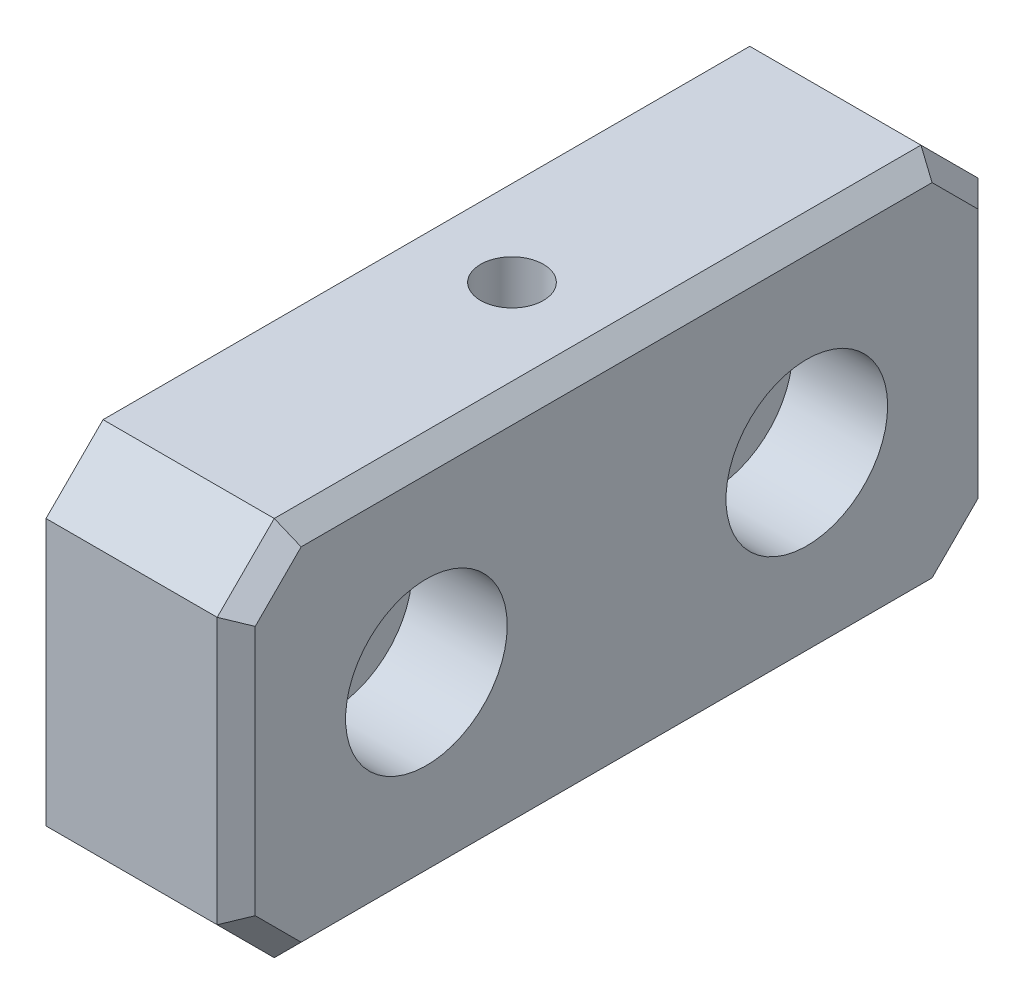
ISO-10303-21;
HEADER;
FILE_DESCRIPTION(('STEP AP214'),'2;1');
FILE_NAME('part.step','',(''),(''),'','','');
FILE_SCHEMA(('AUTOMOTIVE_DESIGN { 1 0 10303 214 1 1 1 1 }'));
ENDSEC;
DATA;
#1=APPLICATION_CONTEXT('core data for automotive mechanical design processes');
#2=APPLICATION_PROTOCOL_DEFINITION('international standard','automotive_design',2000,#1);
#3=PRODUCT_CONTEXT('',#1,'mechanical');
#4=PRODUCT('Part','Part','',(#3));
#5=PRODUCT_RELATED_PRODUCT_CATEGORY('part','',(#4));
#6=PRODUCT_DEFINITION_FORMATION('','',#4);
#7=PRODUCT_DEFINITION_CONTEXT('part definition',#1,'design');
#8=PRODUCT_DEFINITION('design','',#6,#7);
#9=PRODUCT_DEFINITION_SHAPE('','',#8);
#10=(LENGTH_UNIT() NAMED_UNIT(*) SI_UNIT(.MILLI.,.METRE.));
#11=(NAMED_UNIT(*) PLANE_ANGLE_UNIT() SI_UNIT($,.RADIAN.));
#12=(NAMED_UNIT(*) SI_UNIT($,.STERADIAN.) SOLID_ANGLE_UNIT());
#13=UNCERTAINTY_MEASURE_WITH_UNIT(LENGTH_MEASURE(1.E-05),#10,'distance_accuracy_value','');
#14=(GEOMETRIC_REPRESENTATION_CONTEXT(3) GLOBAL_UNCERTAINTY_ASSIGNED_CONTEXT((#13)) GLOBAL_UNIT_ASSIGNED_CONTEXT((#10,
#11,#12)) REPRESENTATION_CONTEXT('',''));
#15=CARTESIAN_POINT('',(0.,0.,0.));
#16=DIRECTION('',(0.,0.,1.));
#17=DIRECTION('',(1.,0.,0.));
#18=AXIS2_PLACEMENT_3D('',#15,#16,#17);
#19=CARTESIAN_POINT('',(10.,0.,0.));
#20=DIRECTION('',(1.,0.,0.));
#21=DIRECTION('',(0.,0.,-1.));
#22=AXIS2_PLACEMENT_3D('',#19,#20,#21);
#23=PLANE('',#22);
#24=DIRECTION('',(0.,0.,-1.));
#25=VECTOR('',#24,1.);
#26=CARTESIAN_POINT('',(10.,-9.,-17.));
#27=LINE('',#26,#25);
#28=CARTESIAN_POINT('',(10.,-9.,16.5857864376269));
#29=VERTEX_POINT('',#28);
#30=CARTESIAN_POINT('',(10.,-9.,-16.5857864376269));
#31=VERTEX_POINT('',#30);
#32=EDGE_CURVE('E188',#29,#31,#27,.T.);
#33=ORIENTED_EDGE('',*,*,#32,.T.);
#34=DIRECTION('',(0.,0.707106781186547,-0.707106781186548));
#35=VECTOR('',#34,1.);
#36=CARTESIAN_POINT('',(10.,-12.7928932188135,-12.7928932188134));
#37=LINE('',#36,#35);
#38=CARTESIAN_POINT('',(10.,-6.58578643762691,-19.));
#39=VERTEX_POINT('',#38);
#40=EDGE_CURVE('E190',#31,#39,#37,.T.);
#41=ORIENTED_EDGE('',*,*,#40,.T.);
#42=DIRECTION('',(0.,1.,0.));
#43=VECTOR('',#42,1.);
#44=CARTESIAN_POINT('',(10.,6.99999999999997,-19.));
#45=LINE('',#44,#43);
#46=CARTESIAN_POINT('',(10.,6.58578643762688,-19.));
#47=VERTEX_POINT('',#46);
#48=EDGE_CURVE('E176',#39,#47,#45,.T.);
#49=ORIENTED_EDGE('',*,*,#48,.T.);
#50=DIRECTION('',(0.,0.707106781186549,0.707106781186546));
#51=VECTOR('',#50,1.);
#52=CARTESIAN_POINT('',(10.,12.7928932188134,-12.7928932188135));
#53=LINE('',#52,#51);
#54=CARTESIAN_POINT('',(10.,9.,-16.5857864376269));
#55=VERTEX_POINT('',#54);
#56=EDGE_CURVE('E178',#47,#55,#53,.T.);
#57=ORIENTED_EDGE('',*,*,#56,.T.);
#58=DIRECTION('',(0.,0.,1.));
#59=VECTOR('',#58,1.);
#60=CARTESIAN_POINT('',(10.,9.,17.));
#61=LINE('',#60,#59);
#62=CARTESIAN_POINT('',(10.,9.,16.5857864376269));
#63=VERTEX_POINT('',#62);
#64=EDGE_CURVE('E180',#55,#63,#61,.T.);
#65=ORIENTED_EDGE('',*,*,#64,.T.);
#66=DIRECTION('',(0.,-0.707106781186547,0.707106781186548));
#67=VECTOR('',#66,1.);
#68=CARTESIAN_POINT('',(10.,12.7928932188135,12.7928932188134));
#69=LINE('',#68,#67);
#70=CARTESIAN_POINT('',(10.,6.58578643762689,19.));
#71=VERTEX_POINT('',#70);
#72=EDGE_CURVE('E182',#63,#71,#69,.T.);
#73=ORIENTED_EDGE('',*,*,#72,.T.);
#74=DIRECTION('',(0.,-1.,0.));
#75=VECTOR('',#74,1.);
#76=CARTESIAN_POINT('',(10.,-6.99999999999999,19.));
#77=LINE('',#76,#75);
#78=CARTESIAN_POINT('',(10.,-6.58578643762689,19.));
#79=VERTEX_POINT('',#78);
#80=EDGE_CURVE('E184',#71,#79,#77,.T.);
#81=ORIENTED_EDGE('',*,*,#80,.T.);
#82=DIRECTION('',(0.,-0.707106781186549,-0.707106781186546));
#83=VECTOR('',#82,1.);
#84=CARTESIAN_POINT('',(10.,-12.7928932188134,12.7928932188135));
#85=LINE('',#84,#83);
#86=EDGE_CURVE('E186',#79,#29,#85,.T.);
#87=ORIENTED_EDGE('',*,*,#86,.T.);
#88=EDGE_LOOP('',(#33,#41,#49,#57,#65,#73,#81,#87));
#89=FACE_BOUND('',#88,.T.);
#90=CARTESIAN_POINT('',(10.,0.,-10.));
#91=DIRECTION('',(1.,0.,0.));
#92=DIRECTION('',(0.,0.,-1.));
#93=AXIS2_PLACEMENT_3D('',#90,#91,#92);
#94=CIRCLE('',#93,4.25);
#95=CARTESIAN_POINT('',(10.,0.,-14.25));
#96=VERTEX_POINT('',#95);
#97=EDGE_CURVE('E480',#96,#96,#94,.F.);
#98=ORIENTED_EDGE('',*,*,#97,.T.);
#99=EDGE_LOOP('',(#98));
#100=FACE_BOUND('',#99,.T.);
#101=CARTESIAN_POINT('',(10.,0.,10.));
#102=DIRECTION('',(1.,0.,0.));
#103=DIRECTION('',(0.,0.,-1.));
#104=AXIS2_PLACEMENT_3D('',#101,#102,#103);
#105=CIRCLE('',#104,4.25);
#106=CARTESIAN_POINT('',(10.,0.,5.75));
#107=VERTEX_POINT('',#106);
#108=EDGE_CURVE('E493',#107,#107,#105,.T.);
#109=ORIENTED_EDGE('',*,*,#108,.F.);
#110=EDGE_LOOP('',(#109));
#111=FACE_BOUND('',#110,.T.);
#112=ADVANCED_FACE('F35',(#89,#100,#111),#23,.T.);
#113=CARTESIAN_POINT('',(0.,0.,-10.));
#114=DIRECTION('',(1.,0.,0.));
#115=DIRECTION('',(0.,0.,-1.));
#116=AXIS2_PLACEMENT_3D('',#113,#114,#115);
#117=CYLINDRICAL_SURFACE('',#116,2.25);
#118=CARTESIAN_POINT('',(0.,0.,-10.));
#119=DIRECTION('',(1.,0.,0.));
#120=DIRECTION('',(0.,0.,-1.));
#121=AXIS2_PLACEMENT_3D('',#118,#119,#120);
#122=CIRCLE('',#121,2.25);
#123=CARTESIAN_POINT('',(0.,0.,-12.25));
#124=VERTEX_POINT('',#123);
#125=EDGE_CURVE('E496',#124,#124,#122,.F.);
#126=ORIENTED_EDGE('',*,*,#125,.T.);
#127=EDGE_LOOP('',(#126));
#128=FACE_BOUND('',#127,.T.);
#129=CARTESIAN_POINT('',(5.,0.,-10.));
#130=DIRECTION('',(1.,0.,0.));
#131=DIRECTION('',(0.,0.,-1.));
#132=AXIS2_PLACEMENT_3D('',#129,#130,#131);
#133=CIRCLE('',#132,2.25);
#134=CARTESIAN_POINT('',(5.,0.,-12.25));
#135=VERTEX_POINT('',#134);
#136=EDGE_CURVE('E484',#135,#135,#133,.F.);
#137=ORIENTED_EDGE('',*,*,#136,.F.);
#138=EDGE_LOOP('',(#137));
#139=FACE_BOUND('',#138,.T.);
#140=ADVANCED_FACE('F295',(#128,#139),#117,.F.);
#141=CARTESIAN_POINT('',(0.,0.,10.));
#142=DIRECTION('',(1.,0.,0.));
#143=DIRECTION('',(0.,0.,-1.));
#144=AXIS2_PLACEMENT_3D('',#141,#142,#143);
#145=CYLINDRICAL_SURFACE('',#144,2.25);
#146=CARTESIAN_POINT('',(0.,0.,10.));
#147=DIRECTION('',(1.,0.,0.));
#148=DIRECTION('',(0.,0.,-1.));
#149=AXIS2_PLACEMENT_3D('',#146,#147,#148);
#150=CIRCLE('',#149,2.25);
#151=CARTESIAN_POINT('',(0.,0.,7.75));
#152=VERTEX_POINT('',#151);
#153=EDGE_CURVE('E209',#152,#152,#150,.T.);
#154=ORIENTED_EDGE('',*,*,#153,.F.);
#155=EDGE_LOOP('',(#154));
#156=FACE_BOUND('',#155,.T.);
#157=CARTESIAN_POINT('',(5.,0.,10.));
#158=DIRECTION('',(1.,0.,0.));
#159=DIRECTION('',(0.,0.,-1.));
#160=AXIS2_PLACEMENT_3D('',#157,#158,#159);
#161=CIRCLE('',#160,2.25);
#162=CARTESIAN_POINT('',(5.,0.,7.75));
#163=VERTEX_POINT('',#162);
#164=EDGE_CURVE('E492',#163,#163,#161,.T.);
#165=ORIENTED_EDGE('',*,*,#164,.T.);
#166=EDGE_LOOP('',(#165));
#167=FACE_BOUND('',#166,.T.);
#168=ADVANCED_FACE('F300',(#156,#167),#145,.F.);
#169=CARTESIAN_POINT('',(0.,0.,0.));
#170=DIRECTION('',(1.,0.,0.));
#171=DIRECTION('',(0.,0.,-1.));
#172=AXIS2_PLACEMENT_3D('',#169,#170,#171);
#173=PLANE('',#172);
#174=DIRECTION('',(0.,0.,1.));
#175=VECTOR('',#174,1.);
#176=CARTESIAN_POINT('',(0.,10.,20.));
#177=LINE('',#176,#175);
#178=CARTESIAN_POINT('',(0.,10.,-17.));
#179=VERTEX_POINT('',#178);
#180=CARTESIAN_POINT('',(0.,10.,17.));
#181=VERTEX_POINT('',#180);
#182=EDGE_CURVE('E129',#179,#181,#177,.T.);
#183=ORIENTED_EDGE('',*,*,#182,.F.);
#184=DIRECTION('',(0.,0.707106781186549,0.707106781186546));
#185=VECTOR('',#184,1.);
#186=CARTESIAN_POINT('',(0.,10.,-17.));
#187=LINE('',#186,#185);
#188=CARTESIAN_POINT('',(0.,6.99999999999997,-20.));
#189=VERTEX_POINT('',#188);
#190=EDGE_CURVE('E135',#179,#189,#187,.F.);
#191=ORIENTED_EDGE('',*,*,#190,.T.);
#192=DIRECTION('',(0.,1.,0.));
#193=VECTOR('',#192,1.);
#194=CARTESIAN_POINT('',(0.,10.,-20.));
#195=LINE('',#194,#193);
#196=CARTESIAN_POINT('',(0.,-7.,-20.));
#197=VERTEX_POINT('',#196);
#198=EDGE_CURVE('E149',#197,#189,#195,.T.);
#199=ORIENTED_EDGE('',*,*,#198,.F.);
#200=DIRECTION('',(0.,0.707106781186547,-0.707106781186548));
#201=VECTOR('',#200,1.);
#202=CARTESIAN_POINT('',(0.,-7.,-20.));
#203=LINE('',#202,#201);
#204=CARTESIAN_POINT('',(0.,-10.,-17.));
#205=VERTEX_POINT('',#204);
#206=EDGE_CURVE('E142',#197,#205,#203,.F.);
#207=ORIENTED_EDGE('',*,*,#206,.T.);
#208=DIRECTION('',(0.,0.,-1.));
#209=VECTOR('',#208,1.);
#210=CARTESIAN_POINT('',(0.,-10.,20.));
#211=LINE('',#210,#209);
#212=CARTESIAN_POINT('',(0.,-10.,17.));
#213=VERTEX_POINT('',#212);
#214=EDGE_CURVE('E152',#213,#205,#211,.T.);
#215=ORIENTED_EDGE('',*,*,#214,.F.);
#216=DIRECTION('',(0.,-0.707106781186549,-0.707106781186546));
#217=VECTOR('',#216,1.);
#218=CARTESIAN_POINT('',(0.,-10.,17.));
#219=LINE('',#218,#217);
#220=CARTESIAN_POINT('',(0.,-6.99999999999999,20.));
#221=VERTEX_POINT('',#220);
#222=EDGE_CURVE('E161',#213,#221,#219,.F.);
#223=ORIENTED_EDGE('',*,*,#222,.T.);
#224=DIRECTION('',(0.,-1.,0.));
#225=VECTOR('',#224,1.);
#226=CARTESIAN_POINT('',(0.,10.,20.));
#227=LINE('',#226,#225);
#228=CARTESIAN_POINT('',(0.,6.99999999999999,20.));
#229=VERTEX_POINT('',#228);
#230=EDGE_CURVE('E148',#229,#221,#227,.T.);
#231=ORIENTED_EDGE('',*,*,#230,.F.);
#232=DIRECTION('',(0.,-0.707106781186547,0.707106781186548));
#233=VECTOR('',#232,1.);
#234=CARTESIAN_POINT('',(0.,6.99999999999999,20.));
#235=LINE('',#234,#233);
#236=EDGE_CURVE('E132',#229,#181,#235,.F.);
#237=ORIENTED_EDGE('',*,*,#236,.T.);
#238=EDGE_LOOP('',(#183,#191,#199,#207,#215,#223,#231,#237));
#239=FACE_BOUND('',#238,.T.);
#240=ORIENTED_EDGE('',*,*,#125,.F.);
#241=EDGE_LOOP('',(#240));
#242=FACE_BOUND('',#241,.T.);
#243=ORIENTED_EDGE('',*,*,#153,.T.);
#244=EDGE_LOOP('',(#243));
#245=FACE_BOUND('',#244,.T.);
#246=ADVANCED_FACE('F144',(#239,#242,#245),#173,.F.);
#247=CARTESIAN_POINT('',(10.,10.,-20.));
#248=DIRECTION('',(0.,0.,1.));
#249=DIRECTION('',(1.,0.,0.));
#250=AXIS2_PLACEMENT_3D('',#247,#248,#249);
#251=PLANE('',#250);
#252=DIRECTION('',(1.,0.,0.));
#253=VECTOR('',#252,1.);
#254=CARTESIAN_POINT('',(10.,6.99999999999997,-20.));
#255=LINE('',#254,#253);
#256=CARTESIAN_POINT('',(8.99999999999999,6.99999999999997,-20.));
#257=VERTEX_POINT('',#256);
#258=EDGE_CURVE('E137',#189,#257,#255,.T.);
#259=ORIENTED_EDGE('',*,*,#258,.T.);
#260=DIRECTION('',(0.,-1.,0.));
#261=VECTOR('',#260,1.);
#262=CARTESIAN_POINT('',(8.99999999999999,-7.,-20.));
#263=LINE('',#262,#261);
#264=CARTESIAN_POINT('',(8.99999999999999,-7.,-20.));
#265=VERTEX_POINT('',#264);
#266=EDGE_CURVE('E11',#257,#265,#263,.T.);
#267=ORIENTED_EDGE('',*,*,#266,.T.);
#268=DIRECTION('',(-1.,0.,0.));
#269=VECTOR('',#268,1.);
#270=CARTESIAN_POINT('',(10.,-7.,-20.));
#271=LINE('',#270,#269);
#272=EDGE_CURVE('E141',#265,#197,#271,.T.);
#273=ORIENTED_EDGE('',*,*,#272,.T.);
#274=ORIENTED_EDGE('',*,*,#198,.T.);
#275=EDGE_LOOP('',(#259,#267,#273,#274));
#276=FACE_BOUND('',#275,.T.);
#277=ADVANCED_FACE('F273',(#276),#251,.F.);
#278=CARTESIAN_POINT('',(10.,10.,20.));
#279=DIRECTION('',(0.,-1.,0.));
#280=DIRECTION('',(0.,0.,-1.));
#281=AXIS2_PLACEMENT_3D('',#278,#279,#280);
#282=PLANE('',#281);
#283=CARTESIAN_POINT('',(4.5,10.,0.));
#284=DIRECTION('',(0.,1.,0.));
#285=DIRECTION('',(0.,0.,1.));
#286=AXIS2_PLACEMENT_3D('',#283,#284,#285);
#287=CIRCLE('',#286,1.65);
#288=CARTESIAN_POINT('',(4.5,10.,1.65));
#289=VERTEX_POINT('',#288);
#290=EDGE_CURVE('E481',#289,#289,#287,.T.);
#291=ORIENTED_EDGE('',*,*,#290,.F.);
#292=EDGE_LOOP('',(#291));
#293=FACE_BOUND('',#292,.T.);
#294=DIRECTION('',(1.,0.,0.));
#295=VECTOR('',#294,1.);
#296=CARTESIAN_POINT('',(10.,10.,17.));
#297=LINE('',#296,#295);
#298=CARTESIAN_POINT('',(8.99999999999999,10.,17.));
#299=VERTEX_POINT('',#298);
#300=EDGE_CURVE('E133',#181,#299,#297,.T.);
#301=ORIENTED_EDGE('',*,*,#300,.T.);
#302=DIRECTION('',(0.,0.,-1.));
#303=VECTOR('',#302,1.);
#304=CARTESIAN_POINT('',(8.99999999999999,10.,-17.));
#305=LINE('',#304,#303);
#306=CARTESIAN_POINT('',(8.99999999999999,10.,-17.));
#307=VERTEX_POINT('',#306);
#308=EDGE_CURVE('E60',#299,#307,#305,.T.);
#309=ORIENTED_EDGE('',*,*,#308,.T.);
#310=DIRECTION('',(-1.,0.,0.));
#311=VECTOR('',#310,1.);
#312=CARTESIAN_POINT('',(10.,10.,-17.));
#313=LINE('',#312,#311);
#314=EDGE_CURVE('E125',#307,#179,#313,.T.);
#315=ORIENTED_EDGE('',*,*,#314,.T.);
#316=ORIENTED_EDGE('',*,*,#182,.T.);
#317=EDGE_LOOP('',(#301,#309,#315,#316));
#318=FACE_BOUND('',#317,.T.);
#319=ADVANCED_FACE('F127',(#293,#318),#282,.F.);
#320=CARTESIAN_POINT('',(10.,10.,20.));
#321=DIRECTION('',(0.,0.,-1.));
#322=DIRECTION('',(0.,1.,0.));
#323=AXIS2_PLACEMENT_3D('',#320,#321,#322);
#324=PLANE('',#323);
#325=DIRECTION('',(1.,0.,0.));
#326=VECTOR('',#325,1.);
#327=CARTESIAN_POINT('',(10.,-6.99999999999999,20.));
#328=LINE('',#327,#326);
#329=CARTESIAN_POINT('',(8.99999999999999,-6.99999999999999,20.));
#330=VERTEX_POINT('',#329);
#331=EDGE_CURVE('E173',#221,#330,#328,.T.);
#332=ORIENTED_EDGE('',*,*,#331,.T.);
#333=DIRECTION('',(0.,1.,0.));
#334=VECTOR('',#333,1.);
#335=CARTESIAN_POINT('',(8.99999999999999,6.99999999999999,20.));
#336=LINE('',#335,#334);
#337=CARTESIAN_POINT('',(8.99999999999999,6.99999999999999,20.));
#338=VERTEX_POINT('',#337);
#339=EDGE_CURVE('E200',#330,#338,#336,.T.);
#340=ORIENTED_EDGE('',*,*,#339,.T.);
#341=DIRECTION('',(-1.,0.,0.));
#342=VECTOR('',#341,1.);
#343=CARTESIAN_POINT('',(10.,6.99999999999999,20.));
#344=LINE('',#343,#342);
#345=EDGE_CURVE('E171',#338,#229,#344,.T.);
#346=ORIENTED_EDGE('',*,*,#345,.T.);
#347=ORIENTED_EDGE('',*,*,#230,.T.);
#348=EDGE_LOOP('',(#332,#340,#346,#347));
#349=FACE_BOUND('',#348,.T.);
#350=ADVANCED_FACE('F241',(#349),#324,.F.);
#351=CARTESIAN_POINT('',(10.,-10.,20.));
#352=DIRECTION('',(0.,1.,0.));
#353=DIRECTION('',(0.,0.,1.));
#354=AXIS2_PLACEMENT_3D('',#351,#352,#353);
#355=PLANE('',#354);
#356=DIRECTION('',(1.,0.,0.));
#357=VECTOR('',#356,1.);
#358=CARTESIAN_POINT('',(10.,-10.,-17.));
#359=LINE('',#358,#357);
#360=CARTESIAN_POINT('',(8.99999999999999,-10.,-17.));
#361=VERTEX_POINT('',#360);
#362=EDGE_CURVE('E168',#205,#361,#359,.T.);
#363=ORIENTED_EDGE('',*,*,#362,.T.);
#364=DIRECTION('',(0.,0.,1.));
#365=VECTOR('',#364,1.);
#366=CARTESIAN_POINT('',(8.99999999999999,-10.,17.));
#367=LINE('',#366,#365);
#368=CARTESIAN_POINT('',(8.99999999999999,-10.,17.));
#369=VERTEX_POINT('',#368);
#370=EDGE_CURVE('E196',#361,#369,#367,.T.);
#371=ORIENTED_EDGE('',*,*,#370,.T.);
#372=DIRECTION('',(-1.,0.,0.));
#373=VECTOR('',#372,1.);
#374=CARTESIAN_POINT('',(10.,-10.,17.));
#375=LINE('',#374,#373);
#376=EDGE_CURVE('E166',#369,#213,#375,.T.);
#377=ORIENTED_EDGE('',*,*,#376,.T.);
#378=ORIENTED_EDGE('',*,*,#214,.T.);
#379=EDGE_LOOP('',(#363,#371,#377,#378));
#380=FACE_BOUND('',#379,.T.);
#381=ADVANCED_FACE('F307',(#380),#355,.F.);
#382=CARTESIAN_POINT('',(10.,10.,-17.));
#383=DIRECTION('',(0.,-0.707106781186546,0.707106781186549));
#384=DIRECTION('',(-1.,0.,0.));
#385=AXIS2_PLACEMENT_3D('',#382,#383,#384);
#386=PLANE('',#385);
#387=ORIENTED_EDGE('',*,*,#314,.F.);
#388=DIRECTION('',(0.,0.707106781186549,0.707106781186546));
#389=VECTOR('',#388,1.);
#390=CARTESIAN_POINT('',(8.99999999999999,10.,-17.));
#391=LINE('',#390,#389);
#392=EDGE_CURVE('E45',#307,#257,#391,.F.);
#393=ORIENTED_EDGE('',*,*,#392,.T.);
#394=ORIENTED_EDGE('',*,*,#258,.F.);
#395=ORIENTED_EDGE('',*,*,#190,.F.);
#396=EDGE_LOOP('',(#387,#393,#394,#395));
#397=FACE_BOUND('',#396,.T.);
#398=ADVANCED_FACE('F136',(#397),#386,.F.);
#399=CARTESIAN_POINT('',(10.,-7.,-20.));
#400=DIRECTION('',(0.,0.707106781186548,0.707106781186547));
#401=DIRECTION('',(-1.,0.,0.));
#402=AXIS2_PLACEMENT_3D('',#399,#400,#401);
#403=PLANE('',#402);
#404=ORIENTED_EDGE('',*,*,#272,.F.);
#405=DIRECTION('',(0.,0.707106781186547,-0.707106781186548));
#406=VECTOR('',#405,1.);
#407=CARTESIAN_POINT('',(8.99999999999999,-7.,-20.));
#408=LINE('',#407,#406);
#409=EDGE_CURVE('E193',#265,#361,#408,.F.);
#410=ORIENTED_EDGE('',*,*,#409,.T.);
#411=ORIENTED_EDGE('',*,*,#362,.F.);
#412=ORIENTED_EDGE('',*,*,#206,.F.);
#413=EDGE_LOOP('',(#404,#410,#411,#412));
#414=FACE_BOUND('',#413,.T.);
#415=ADVANCED_FACE('F277',(#414),#403,.F.);
#416=CARTESIAN_POINT('',(10.,-10.,17.));
#417=DIRECTION('',(0.,0.707106781186546,-0.707106781186549));
#418=DIRECTION('',(-1.,0.,0.));
#419=AXIS2_PLACEMENT_3D('',#416,#417,#418);
#420=PLANE('',#419);
#421=ORIENTED_EDGE('',*,*,#376,.F.);
#422=DIRECTION('',(0.,-0.707106781186549,-0.707106781186546));
#423=VECTOR('',#422,1.);
#424=CARTESIAN_POINT('',(8.99999999999999,-10.,17.));
#425=LINE('',#424,#423);
#426=EDGE_CURVE('E198',#369,#330,#425,.F.);
#427=ORIENTED_EDGE('',*,*,#426,.T.);
#428=ORIENTED_EDGE('',*,*,#331,.F.);
#429=ORIENTED_EDGE('',*,*,#222,.F.);
#430=EDGE_LOOP('',(#421,#427,#428,#429));
#431=FACE_BOUND('',#430,.T.);
#432=ADVANCED_FACE('F246',(#431),#420,.F.);
#433=CARTESIAN_POINT('',(10.,6.99999999999999,20.));
#434=DIRECTION('',(0.,-0.707106781186548,-0.707106781186547));
#435=DIRECTION('',(-1.,0.,0.));
#436=AXIS2_PLACEMENT_3D('',#433,#434,#435);
#437=PLANE('',#436);
#438=ORIENTED_EDGE('',*,*,#345,.F.);
#439=DIRECTION('',(0.,-0.707106781186547,0.707106781186548));
#440=VECTOR('',#439,1.);
#441=CARTESIAN_POINT('',(8.99999999999999,6.99999999999999,20.));
#442=LINE('',#441,#440);
#443=EDGE_CURVE('E202',#338,#299,#442,.F.);
#444=ORIENTED_EDGE('',*,*,#443,.T.);
#445=ORIENTED_EDGE('',*,*,#300,.F.);
#446=ORIENTED_EDGE('',*,*,#236,.F.);
#447=EDGE_LOOP('',(#438,#444,#445,#446));
#448=FACE_BOUND('',#447,.T.);
#449=ADVANCED_FACE('F239',(#448),#437,.F.);
#450=CARTESIAN_POINT('',(10.,12.7928932188135,12.7928932188134));
#451=DIRECTION('',(0.707106781186546,0.500000000000002,0.500000000000001));
#452=DIRECTION('',(0.,0.707106781186547,-0.707106781186548));
#453=AXIS2_PLACEMENT_3D('',#450,#451,#452);
#454=PLANE('',#453);
#455=DIRECTION('',(0.678598344545849,-0.678598344545845,-0.281084637714821));
#456=VECTOR('',#455,1.);
#457=CARTESIAN_POINT('',(13.16363211356,5.83636788643999,15.2753671098313));
#458=LINE('',#457,#456);
#459=EDGE_CURVE('E222',#299,#63,#458,.T.);
#460=ORIENTED_EDGE('',*,*,#459,.F.);
#461=ORIENTED_EDGE('',*,*,#443,.F.);
#462=DIRECTION('',(0.67859834454585,-0.281084637714826,-0.678598344545842));
#463=VECTOR('',#462,1.);
#464=CARTESIAN_POINT('',(11.6743803584745,5.89223538457561,17.3256196415255));
#465=LINE('',#464,#463);
#466=EDGE_CURVE('E40',#71,#338,#465,.F.);
#467=ORIENTED_EDGE('',*,*,#466,.F.);
#468=ORIENTED_EDGE('',*,*,#72,.F.);
#469=EDGE_LOOP('',(#460,#461,#467,#468));
#470=FACE_BOUND('',#469,.T.);
#471=ADVANCED_FACE('F38',(#470),#454,.T.);
#472=CARTESIAN_POINT('',(10.,0.,19.));
#473=DIRECTION('',(0.707106781186543,0.,0.707106781186552));
#474=DIRECTION('',(0.,1.,0.));
#475=AXIS2_PLACEMENT_3D('',#472,#473,#474);
#476=PLANE('',#475);
#477=ORIENTED_EDGE('',*,*,#466,.T.);
#478=ORIENTED_EDGE('',*,*,#339,.F.);
#479=DIRECTION('',(0.678598344545851,0.281084637714823,-0.678598344545842));
#480=VECTOR('',#479,1.);
#481=CARTESIAN_POINT('',(11.2561964152546,-6.06545284542398,17.7438035847455));
#482=LINE('',#481,#480);
#483=EDGE_CURVE('E220',#79,#330,#482,.F.);
#484=ORIENTED_EDGE('',*,*,#483,.F.);
#485=ORIENTED_EDGE('',*,*,#80,.F.);
#486=EDGE_LOOP('',(#477,#478,#484,#485));
#487=FACE_BOUND('',#486,.T.);
#488=ADVANCED_FACE('F232',(#487),#476,.T.);
#489=CARTESIAN_POINT('',(10.,9.,0.));
#490=DIRECTION('',(0.707106781186545,0.70710678118655,0.));
#491=DIRECTION('',(0.,0.,-1.));
#492=AXIS2_PLACEMENT_3D('',#489,#490,#491);
#493=PLANE('',#492);
#494=ORIENTED_EDGE('',*,*,#459,.T.);
#495=ORIENTED_EDGE('',*,*,#64,.F.);
#496=DIRECTION('',(0.678598344545849,-0.678598344545845,0.28108463771482));
#497=VECTOR('',#496,1.);
#498=CARTESIAN_POINT('',(8.97685892457637,10.0231410754236,-17.0095853472884));
#499=LINE('',#498,#497);
#500=EDGE_CURVE('E217',#307,#55,#499,.T.);
#501=ORIENTED_EDGE('',*,*,#500,.F.);
#502=ORIENTED_EDGE('',*,*,#308,.F.);
#503=EDGE_LOOP('',(#494,#495,#501,#502));
#504=FACE_BOUND('',#503,.T.);
#505=ADVANCED_FACE('F262',(#504),#493,.T.);
#506=CARTESIAN_POINT('',(10.,-12.7928932188134,12.7928932188135));
#507=DIRECTION('',(0.707106781186545,-0.5,0.500000000000003));
#508=DIRECTION('',(0.,0.707106781186549,0.707106781186546));
#509=AXIS2_PLACEMENT_3D('',#506,#507,#508);
#510=PLANE('',#509);
#511=ORIENTED_EDGE('',*,*,#483,.T.);
#512=ORIENTED_EDGE('',*,*,#426,.F.);
#513=DIRECTION('',(0.678598344545849,0.678598344545845,-0.281084637714821));
#514=VECTOR('',#513,1.);
#515=CARTESIAN_POINT('',(8.97685892457637,-10.0231410754236,17.0095853472884));
#516=LINE('',#515,#514);
#517=EDGE_CURVE('E214',#29,#369,#516,.F.);
#518=ORIENTED_EDGE('',*,*,#517,.F.);
#519=ORIENTED_EDGE('',*,*,#86,.F.);
#520=EDGE_LOOP('',(#511,#512,#518,#519));
#521=FACE_BOUND('',#520,.T.);
#522=ADVANCED_FACE('F251',(#521),#510,.T.);
#523=CARTESIAN_POINT('',(10.,12.7928932188134,-12.7928932188135));
#524=DIRECTION('',(0.707106781186545,0.500000000000001,-0.500000000000003));
#525=DIRECTION('',(0.,-0.707106781186549,-0.707106781186546));
#526=AXIS2_PLACEMENT_3D('',#523,#524,#525);
#527=PLANE('',#526);
#528=ORIENTED_EDGE('',*,*,#500,.T.);
#529=ORIENTED_EDGE('',*,*,#56,.F.);
#530=DIRECTION('',(0.67859834454585,-0.281084637714819,0.678598344545845));
#531=VECTOR('',#530,1.);
#532=CARTESIAN_POINT('',(11.2561964152545,6.06545284542399,-17.7438035847455));
#533=LINE('',#532,#531);
#534=EDGE_CURVE('E211',#257,#47,#533,.T.);
#535=ORIENTED_EDGE('',*,*,#534,.F.);
#536=ORIENTED_EDGE('',*,*,#392,.F.);
#537=EDGE_LOOP('',(#528,#529,#535,#536));
#538=FACE_BOUND('',#537,.T.);
#539=ADVANCED_FACE('F264',(#538),#527,.T.);
#540=CARTESIAN_POINT('',(10.,-9.,0.));
#541=DIRECTION('',(0.707106781186545,-0.70710678118655,0.));
#542=DIRECTION('',(0.,0.,1.));
#543=AXIS2_PLACEMENT_3D('',#540,#541,#542);
#544=PLANE('',#543);
#545=ORIENTED_EDGE('',*,*,#517,.T.);
#546=ORIENTED_EDGE('',*,*,#370,.F.);
#547=DIRECTION('',(0.67859834454585,0.678598344545845,0.281084637714819));
#548=VECTOR('',#547,1.);
#549=CARTESIAN_POINT('',(13.16363211356,-5.83636788644001,-15.2753671098313));
#550=LINE('',#549,#548);
#551=EDGE_CURVE('E208',#31,#361,#550,.F.);
#552=ORIENTED_EDGE('',*,*,#551,.F.);
#553=ORIENTED_EDGE('',*,*,#32,.F.);
#554=EDGE_LOOP('',(#545,#546,#552,#553));
#555=FACE_BOUND('',#554,.T.);
#556=ADVANCED_FACE('F256',(#555),#544,.T.);
#557=CARTESIAN_POINT('',(10.,0.,-19.));
#558=DIRECTION('',(0.707106781186545,0.,-0.70710678118655));
#559=DIRECTION('',(0.,-1.,0.));
#560=AXIS2_PLACEMENT_3D('',#557,#558,#559);
#561=PLANE('',#560);
#562=ORIENTED_EDGE('',*,*,#534,.T.);
#563=ORIENTED_EDGE('',*,*,#48,.F.);
#564=DIRECTION('',(-0.67859834454585,-0.28108463771482,-0.678598344545845));
#565=VECTOR('',#564,1.);
#566=CARTESIAN_POINT('',(11.2561964152546,-6.06545284542401,-17.7438035847455));
#567=LINE('',#566,#565);
#568=EDGE_CURVE('E206',#265,#39,#567,.F.);
#569=ORIENTED_EDGE('',*,*,#568,.F.);
#570=ORIENTED_EDGE('',*,*,#266,.F.);
#571=EDGE_LOOP('',(#562,#563,#569,#570));
#572=FACE_BOUND('',#571,.T.);
#573=ADVANCED_FACE('F270',(#572),#561,.T.);
#574=CARTESIAN_POINT('',(10.,-12.7928932188135,-12.7928932188134));
#575=DIRECTION('',(0.707106781186545,-0.500000000000002,-0.500000000000001));
#576=DIRECTION('',(0.,-0.707106781186547,0.707106781186548));
#577=AXIS2_PLACEMENT_3D('',#574,#575,#576);
#578=PLANE('',#577);
#579=ORIENTED_EDGE('',*,*,#551,.T.);
#580=ORIENTED_EDGE('',*,*,#409,.F.);
#581=ORIENTED_EDGE('',*,*,#568,.T.);
#582=ORIENTED_EDGE('',*,*,#40,.F.);
#583=EDGE_LOOP('',(#579,#580,#581,#582));
#584=FACE_BOUND('',#583,.T.);
#585=ADVANCED_FACE('F280',(#584),#578,.T.);
#586=CARTESIAN_POINT('',(5.,0.,10.));
#587=DIRECTION('',(1.,0.,0.));
#588=DIRECTION('',(0.,0.,-1.));
#589=AXIS2_PLACEMENT_3D('',#586,#587,#588);
#590=CYLINDRICAL_SURFACE('',#589,4.25);
#591=CARTESIAN_POINT('',(5.,0.,10.));
#592=DIRECTION('',(1.,0.,0.));
#593=DIRECTION('',(0.,0.,-1.));
#594=AXIS2_PLACEMENT_3D('',#591,#592,#593);
#595=CIRCLE('',#594,4.25);
#596=CARTESIAN_POINT('',(5.,0.,5.75));
#597=VERTEX_POINT('',#596);
#598=EDGE_CURVE('E489',#597,#597,#595,.T.);
#599=ORIENTED_EDGE('',*,*,#598,.F.);
#600=EDGE_LOOP('',(#599));
#601=FACE_BOUND('',#600,.T.);
#602=ORIENTED_EDGE('',*,*,#108,.T.);
#603=EDGE_LOOP('',(#602));
#604=FACE_BOUND('',#603,.T.);
#605=ADVANCED_FACE('F282',(#601,#604),#590,.F.);
#606=CARTESIAN_POINT('',(5.,0.,0.));
#607=DIRECTION('',(1.,0.,0.));
#608=DIRECTION('',(0.,0.,-1.));
#609=AXIS2_PLACEMENT_3D('',#606,#607,#608);
#610=PLANE('',#609);
#611=ORIENTED_EDGE('',*,*,#598,.T.);
#612=EDGE_LOOP('',(#611));
#613=FACE_BOUND('',#612,.T.);
#614=ORIENTED_EDGE('',*,*,#164,.F.);
#615=EDGE_LOOP('',(#614));
#616=FACE_BOUND('',#615,.T.);
#617=ADVANCED_FACE('F288',(#613,#616),#610,.T.);
#618=CARTESIAN_POINT('',(5.,0.,-10.));
#619=DIRECTION('',(1.,0.,0.));
#620=DIRECTION('',(0.,0.,-1.));
#621=AXIS2_PLACEMENT_3D('',#618,#619,#620);
#622=CYLINDRICAL_SURFACE('',#621,4.25);
#623=CARTESIAN_POINT('',(5.,0.,-10.));
#624=DIRECTION('',(1.,0.,0.));
#625=DIRECTION('',(0.,0.,-1.));
#626=AXIS2_PLACEMENT_3D('',#623,#624,#625);
#627=CIRCLE('',#626,4.25);
#628=CARTESIAN_POINT('',(5.,0.,-14.25));
#629=VERTEX_POINT('',#628);
#630=EDGE_CURVE('E499',#629,#629,#627,.F.);
#631=ORIENTED_EDGE('',*,*,#630,.T.);
#632=EDGE_LOOP('',(#631));
#633=FACE_BOUND('',#632,.T.);
#634=ORIENTED_EDGE('',*,*,#97,.F.);
#635=EDGE_LOOP('',(#634));
#636=FACE_BOUND('',#635,.T.);
#637=ADVANCED_FACE('F424',(#633,#636),#622,.F.);
#638=CARTESIAN_POINT('',(5.,0.,0.));
#639=DIRECTION('',(1.,0.,0.));
#640=DIRECTION('',(0.,0.,-1.));
#641=AXIS2_PLACEMENT_3D('',#638,#639,#640);
#642=PLANE('',#641);
#643=ORIENTED_EDGE('',*,*,#136,.T.);
#644=EDGE_LOOP('',(#643));
#645=FACE_BOUND('',#644,.T.);
#646=ORIENTED_EDGE('',*,*,#630,.F.);
#647=EDGE_LOOP('',(#646));
#648=FACE_BOUND('',#647,.T.);
#649=ADVANCED_FACE('F434',(#645,#648),#642,.T.);
#650=CARTESIAN_POINT('',(4.5,5.,0.));
#651=DIRECTION('',(0.,1.,0.));
#652=DIRECTION('',(0.,0.,1.));
#653=AXIS2_PLACEMENT_3D('',#650,#651,#652);
#654=CYLINDRICAL_SURFACE('',#653,1.65);
#655=CARTESIAN_POINT('',(4.5,5.,0.));
#656=DIRECTION('',(0.,1.,0.));
#657=DIRECTION('',(0.,0.,1.));
#658=AXIS2_PLACEMENT_3D('',#655,#656,#657);
#659=CIRCLE('',#658,1.65);
#660=CARTESIAN_POINT('',(4.5,5.,1.65));
#661=VERTEX_POINT('',#660);
#662=EDGE_CURVE('E479',#661,#661,#659,.T.);
#663=ORIENTED_EDGE('',*,*,#662,.F.);
#664=EDGE_LOOP('',(#663));
#665=FACE_BOUND('',#664,.T.);
#666=ORIENTED_EDGE('',*,*,#290,.T.);
#667=EDGE_LOOP('',(#666));
#668=FACE_BOUND('',#667,.T.);
#669=ADVANCED_FACE('F445',(#665,#668),#654,.F.);
#670=CARTESIAN_POINT('',(4.5,5.,0.));
#671=DIRECTION('',(0.,1.,0.));
#672=DIRECTION('',(0.,0.,1.));
#673=AXIS2_PLACEMENT_3D('',#670,#671,#672);
#674=PLANE('',#673);
#675=ORIENTED_EDGE('',*,*,#662,.T.);
#676=EDGE_LOOP('',(#675));
#677=FACE_BOUND('',#676,.T.);
#678=ADVANCED_FACE('F463',(#677),#674,.T.);
#679=CLOSED_SHELL('',(#112,#140,#168,#246,#277,#319,#350,#381,#398,#415,#432,#449,#471,#488,
#505,#522,#539,#556,#573,#585,#605,#617,#637,#649,#669,#678));
#680=MANIFOLD_SOLID_BREP('B2',#679);
#681=ADVANCED_BREP_SHAPE_REPRESENTATION('',(#18,#680),#14);
#682=SHAPE_DEFINITION_REPRESENTATION(#9,#681);
ENDSEC;
END-ISO-10303-21;
